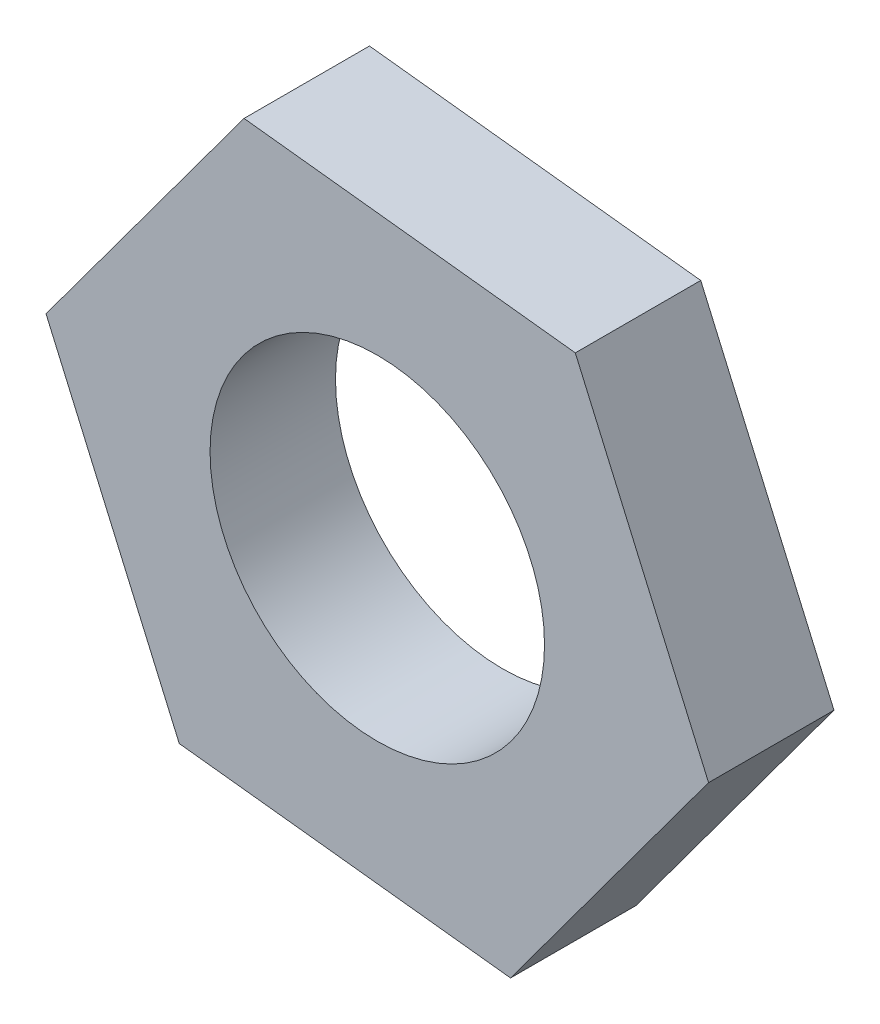
ISO-10303-21;
HEADER;
FILE_DESCRIPTION(('STEP AP214'),'2;1');
FILE_NAME('part.step','',(''),(''),'','','');
FILE_SCHEMA(('AUTOMOTIVE_DESIGN { 1 0 10303 214 1 1 1 1 }'));
ENDSEC;
DATA;
#1=APPLICATION_CONTEXT('core data for automotive mechanical design processes');
#2=APPLICATION_PROTOCOL_DEFINITION('international standard','automotive_design',2000,#1);
#3=PRODUCT_CONTEXT('',#1,'mechanical');
#4=PRODUCT('Part','Part','',(#3));
#5=PRODUCT_RELATED_PRODUCT_CATEGORY('part','',(#4));
#6=PRODUCT_DEFINITION_FORMATION('','',#4);
#7=PRODUCT_DEFINITION_CONTEXT('part definition',#1,'design');
#8=PRODUCT_DEFINITION('design','',#6,#7);
#9=PRODUCT_DEFINITION_SHAPE('','',#8);
#10=(LENGTH_UNIT() NAMED_UNIT(*) SI_UNIT(.MILLI.,.METRE.));
#11=(NAMED_UNIT(*) PLANE_ANGLE_UNIT() SI_UNIT($,.RADIAN.));
#12=(NAMED_UNIT(*) SI_UNIT($,.STERADIAN.) SOLID_ANGLE_UNIT());
#13=UNCERTAINTY_MEASURE_WITH_UNIT(LENGTH_MEASURE(1.E-05),#10,'distance_accuracy_value','');
#14=(GEOMETRIC_REPRESENTATION_CONTEXT(3) GLOBAL_UNCERTAINTY_ASSIGNED_CONTEXT((#13)) GLOBAL_UNIT_ASSIGNED_CONTEXT((#10,
#11,#12)) REPRESENTATION_CONTEXT('',''));
#15=CARTESIAN_POINT('',(0.,0.,0.));
#16=DIRECTION('',(0.,0.,1.));
#17=DIRECTION('',(1.,0.,0.));
#18=AXIS2_PLACEMENT_3D('',#15,#16,#17);
#19=CARTESIAN_POINT('',(3.18715346438534,-7.3094138908074,3.));
#20=DIRECTION('',(0.,0.,1.));
#21=DIRECTION('',(1.,0.,0.));
#22=AXIS2_PLACEMENT_3D('',#19,#20,#21);
#23=PLANE('',#22);
#24=DIRECTION('',(0.993687589434149,-0.112182773207608,0.));
#25=VECTOR('',#24,1.);
#26=CARTESIAN_POINT('',(-4.73656138402139,-6.41486281132099,3.));
#27=LINE('',#26,#25);
#28=CARTESIAN_POINT('',(-4.73656138402139,-6.41486281132099,3.));
#29=VERTEX_POINT('',#28);
#30=CARTESIAN_POINT('',(3.18715346438534,-7.3094138908074,3.));
#31=VERTEX_POINT('',#30);
#32=EDGE_CURVE('E129',#29,#31,#27,.T.);
#33=ORIENTED_EDGE('',*,*,#32,.T.);
#34=DIRECTION('',(0.593996926181851,0.804467309271491,0.));
#35=VECTOR('',#34,1.);
#36=CARTESIAN_POINT('',(3.18715346438534,-7.3094138908074,3.));
#37=LINE('',#36,#35);
#38=CARTESIAN_POINT('',(7.92371484840673,-0.894551079486403,3.));
#39=VERTEX_POINT('',#38);
#40=EDGE_CURVE('E87',#31,#39,#37,.T.);
#41=ORIENTED_EDGE('',*,*,#40,.T.);
#42=DIRECTION('',(-0.399690663252298,0.916650082479099,0.));
#43=VECTOR('',#42,1.);
#44=CARTESIAN_POINT('',(7.92371484840673,-0.894551079486403,3.));
#45=LINE('',#44,#43);
#46=CARTESIAN_POINT('',(4.73656138402139,6.41486281132099,3.));
#47=VERTEX_POINT('',#46);
#48=EDGE_CURVE('E100',#39,#47,#45,.T.);
#49=ORIENTED_EDGE('',*,*,#48,.T.);
#50=DIRECTION('',(-0.993687589434149,0.112182773207607,0.));
#51=VECTOR('',#50,1.);
#52=CARTESIAN_POINT('',(4.73656138402139,6.41486281132099,3.));
#53=LINE('',#52,#51);
#54=CARTESIAN_POINT('',(-3.18715346438534,7.3094138908074,3.));
#55=VERTEX_POINT('',#54);
#56=EDGE_CURVE('E94',#47,#55,#53,.T.);
#57=ORIENTED_EDGE('',*,*,#56,.T.);
#58=DIRECTION('',(-0.593996926181851,-0.804467309271491,0.));
#59=VECTOR('',#58,1.);
#60=CARTESIAN_POINT('',(-3.18715346438534,7.3094138908074,3.));
#61=LINE('',#60,#59);
#62=CARTESIAN_POINT('',(-7.92371484840673,0.894551079486407,3.));
#63=VERTEX_POINT('',#62);
#64=EDGE_CURVE('E98',#55,#63,#61,.T.);
#65=ORIENTED_EDGE('',*,*,#64,.T.);
#66=DIRECTION('',(0.399690663252298,-0.916650082479098,0.));
#67=VECTOR('',#66,1.);
#68=CARTESIAN_POINT('',(-7.92371484840673,0.894551079486407,3.));
#69=LINE('',#68,#67);
#70=EDGE_CURVE('E50',#63,#29,#69,.T.);
#71=ORIENTED_EDGE('',*,*,#70,.T.);
#72=EDGE_LOOP('',(#33,#41,#49,#57,#65,#71));
#73=FACE_BOUND('',#72,.T.);
#74=CARTESIAN_POINT('',(0.,0.,3.));
#75=DIRECTION('',(0.,0.,1.));
#76=DIRECTION('',(1.,0.,0.));
#77=AXIS2_PLACEMENT_3D('',#74,#75,#76);
#78=CIRCLE('',#77,4.);
#79=CARTESIAN_POINT('',(4.,0.,3.));
#80=VERTEX_POINT('',#79);
#81=EDGE_CURVE('E122',#80,#80,#78,.T.);
#82=ORIENTED_EDGE('',*,*,#81,.F.);
#83=EDGE_LOOP('',(#82));
#84=FACE_BOUND('',#83,.T.);
#85=ADVANCED_FACE('F33',(#73,#84),#23,.T.);
#86=CARTESIAN_POINT('',(3.18715346438534,-7.3094138908074,0.));
#87=DIRECTION('',(0.,0.,1.));
#88=DIRECTION('',(1.,0.,0.));
#89=AXIS2_PLACEMENT_3D('',#86,#87,#88);
#90=PLANE('',#89);
#91=DIRECTION('',(0.993687589434149,-0.112182773207608,0.));
#92=VECTOR('',#91,1.);
#93=CARTESIAN_POINT('',(-4.73656138402139,-6.41486281132099,0.));
#94=LINE('',#93,#92);
#95=CARTESIAN_POINT('',(-4.73656138402139,-6.41486281132099,0.));
#96=VERTEX_POINT('',#95);
#97=CARTESIAN_POINT('',(3.18715346438534,-7.3094138908074,0.));
#98=VERTEX_POINT('',#97);
#99=EDGE_CURVE('E118',#96,#98,#94,.T.);
#100=ORIENTED_EDGE('',*,*,#99,.F.);
#101=DIRECTION('',(0.399690663252298,-0.916650082479098,0.));
#102=VECTOR('',#101,1.);
#103=CARTESIAN_POINT('',(-7.92371484840673,0.894551079486407,0.));
#104=LINE('',#103,#102);
#105=CARTESIAN_POINT('',(-7.92371484840673,0.894551079486407,0.));
#106=VERTEX_POINT('',#105);
#107=EDGE_CURVE('E79',#106,#96,#104,.T.);
#108=ORIENTED_EDGE('',*,*,#107,.F.);
#109=DIRECTION('',(-0.593996926181851,-0.804467309271491,0.));
#110=VECTOR('',#109,1.);
#111=CARTESIAN_POINT('',(-3.18715346438534,7.3094138908074,0.));
#112=LINE('',#111,#110);
#113=CARTESIAN_POINT('',(-3.18715346438534,7.3094138908074,0.));
#114=VERTEX_POINT('',#113);
#115=EDGE_CURVE('E73',#114,#106,#112,.T.);
#116=ORIENTED_EDGE('',*,*,#115,.F.);
#117=DIRECTION('',(-0.993687589434149,0.112182773207607,0.));
#118=VECTOR('',#117,1.);
#119=CARTESIAN_POINT('',(4.73656138402139,6.41486281132099,0.));
#120=LINE('',#119,#118);
#121=CARTESIAN_POINT('',(4.73656138402139,6.41486281132099,0.));
#122=VERTEX_POINT('',#121);
#123=EDGE_CURVE('E108',#122,#114,#120,.T.);
#124=ORIENTED_EDGE('',*,*,#123,.F.);
#125=DIRECTION('',(-0.399690663252298,0.916650082479099,0.));
#126=VECTOR('',#125,1.);
#127=CARTESIAN_POINT('',(7.92371484840673,-0.894551079486403,0.));
#128=LINE('',#127,#126);
#129=CARTESIAN_POINT('',(7.92371484840673,-0.894551079486403,0.));
#130=VERTEX_POINT('',#129);
#131=EDGE_CURVE('E124',#130,#122,#128,.T.);
#132=ORIENTED_EDGE('',*,*,#131,.F.);
#133=DIRECTION('',(0.593996926181851,0.804467309271491,0.));
#134=VECTOR('',#133,1.);
#135=CARTESIAN_POINT('',(3.18715346438534,-7.3094138908074,0.));
#136=LINE('',#135,#134);
#137=EDGE_CURVE('E121',#98,#130,#136,.T.);
#138=ORIENTED_EDGE('',*,*,#137,.F.);
#139=EDGE_LOOP('',(#100,#108,#116,#124,#132,#138));
#140=FACE_BOUND('',#139,.T.);
#141=CARTESIAN_POINT('',(0.,0.,0.));
#142=DIRECTION('',(0.,0.,1.));
#143=DIRECTION('',(1.,0.,0.));
#144=AXIS2_PLACEMENT_3D('',#141,#142,#143);
#145=CIRCLE('',#144,4.);
#146=CARTESIAN_POINT('',(4.,0.,0.));
#147=VERTEX_POINT('',#146);
#148=EDGE_CURVE('E222',#147,#147,#145,.T.);
#149=ORIENTED_EDGE('',*,*,#148,.T.);
#150=EDGE_LOOP('',(#149));
#151=FACE_BOUND('',#150,.T.);
#152=ADVANCED_FACE('F138',(#140,#151),#90,.F.);
#153=CARTESIAN_POINT('',(-4.73656138402139,-6.41486281132099,3.));
#154=DIRECTION('',(0.112182773207608,0.993687589434149,0.));
#155=DIRECTION('',(-0.993687589434149,0.112182773207608,0.));
#156=AXIS2_PLACEMENT_3D('',#153,#154,#155);
#157=PLANE('',#156);
#158=ORIENTED_EDGE('',*,*,#99,.T.);
#159=DIRECTION('',(0.,0.,-1.));
#160=VECTOR('',#159,1.);
#161=CARTESIAN_POINT('',(3.18715346438534,-7.3094138908074,3.));
#162=LINE('',#161,#160);
#163=EDGE_CURVE('E11',#31,#98,#162,.T.);
#164=ORIENTED_EDGE('',*,*,#163,.F.);
#165=ORIENTED_EDGE('',*,*,#32,.F.);
#166=DIRECTION('',(0.,0.,-1.));
#167=VECTOR('',#166,1.);
#168=CARTESIAN_POINT('',(-4.73656138402139,-6.41486281132099,3.));
#169=LINE('',#168,#167);
#170=EDGE_CURVE('E114',#29,#96,#169,.T.);
#171=ORIENTED_EDGE('',*,*,#170,.T.);
#172=EDGE_LOOP('',(#158,#164,#165,#171));
#173=FACE_BOUND('',#172,.T.);
#174=ADVANCED_FACE('F35',(#173),#157,.F.);
#175=CARTESIAN_POINT('',(3.18715346438534,-7.3094138908074,3.));
#176=DIRECTION('',(-0.804467309271491,0.593996926181851,0.));
#177=DIRECTION('',(-0.593996926181851,-0.804467309271491,0.));
#178=AXIS2_PLACEMENT_3D('',#175,#176,#177);
#179=PLANE('',#178);
#180=ORIENTED_EDGE('',*,*,#137,.T.);
#181=DIRECTION('',(0.,0.,-1.));
#182=VECTOR('',#181,1.);
#183=CARTESIAN_POINT('',(7.92371484840673,-0.894551079486403,3.));
#184=LINE('',#183,#182);
#185=EDGE_CURVE('E42',#39,#130,#184,.T.);
#186=ORIENTED_EDGE('',*,*,#185,.F.);
#187=ORIENTED_EDGE('',*,*,#40,.F.);
#188=ORIENTED_EDGE('',*,*,#163,.T.);
#189=EDGE_LOOP('',(#180,#186,#187,#188));
#190=FACE_BOUND('',#189,.T.);
#191=ADVANCED_FACE('F163',(#190),#179,.F.);
#192=CARTESIAN_POINT('',(7.92371484840673,-0.894551079486403,3.));
#193=DIRECTION('',(-0.916650082479098,-0.399690663252298,0.));
#194=DIRECTION('',(0.399690663252298,-0.916650082479099,0.));
#195=AXIS2_PLACEMENT_3D('',#192,#193,#194);
#196=PLANE('',#195);
#197=ORIENTED_EDGE('',*,*,#131,.T.);
#198=DIRECTION('',(0.,0.,-1.));
#199=VECTOR('',#198,1.);
#200=CARTESIAN_POINT('',(4.73656138402139,6.41486281132099,3.));
#201=LINE('',#200,#199);
#202=EDGE_CURVE('E109',#47,#122,#201,.T.);
#203=ORIENTED_EDGE('',*,*,#202,.F.);
#204=ORIENTED_EDGE('',*,*,#48,.F.);
#205=ORIENTED_EDGE('',*,*,#185,.T.);
#206=EDGE_LOOP('',(#197,#203,#204,#205));
#207=FACE_BOUND('',#206,.T.);
#208=ADVANCED_FACE('F135',(#207),#196,.F.);
#209=CARTESIAN_POINT('',(4.73656138402139,6.41486281132099,3.));
#210=DIRECTION('',(-0.112182773207607,-0.993687589434149,0.));
#211=DIRECTION('',(0.993687589434149,-0.112182773207607,0.));
#212=AXIS2_PLACEMENT_3D('',#209,#210,#211);
#213=PLANE('',#212);
#214=ORIENTED_EDGE('',*,*,#123,.T.);
#215=DIRECTION('',(0.,0.,-1.));
#216=VECTOR('',#215,1.);
#217=CARTESIAN_POINT('',(-3.18715346438534,7.3094138908074,3.));
#218=LINE('',#217,#216);
#219=EDGE_CURVE('E105',#55,#114,#218,.T.);
#220=ORIENTED_EDGE('',*,*,#219,.F.);
#221=ORIENTED_EDGE('',*,*,#56,.F.);
#222=ORIENTED_EDGE('',*,*,#202,.T.);
#223=EDGE_LOOP('',(#214,#220,#221,#222));
#224=FACE_BOUND('',#223,.T.);
#225=ADVANCED_FACE('F106',(#224),#213,.F.);
#226=CARTESIAN_POINT('',(-3.18715346438534,7.3094138908074,3.));
#227=DIRECTION('',(0.804467309271491,-0.593996926181851,0.));
#228=DIRECTION('',(0.593996926181851,0.804467309271491,0.));
#229=AXIS2_PLACEMENT_3D('',#226,#227,#228);
#230=PLANE('',#229);
#231=ORIENTED_EDGE('',*,*,#115,.T.);
#232=DIRECTION('',(0.,0.,-1.));
#233=VECTOR('',#232,1.);
#234=CARTESIAN_POINT('',(-7.92371484840673,0.894551079486407,3.));
#235=LINE('',#234,#233);
#236=EDGE_CURVE('E110',#63,#106,#235,.T.);
#237=ORIENTED_EDGE('',*,*,#236,.F.);
#238=ORIENTED_EDGE('',*,*,#64,.F.);
#239=ORIENTED_EDGE('',*,*,#219,.T.);
#240=EDGE_LOOP('',(#231,#237,#238,#239));
#241=FACE_BOUND('',#240,.T.);
#242=ADVANCED_FACE('F112',(#241),#230,.F.);
#243=CARTESIAN_POINT('',(-7.92371484840673,0.894551079486407,3.));
#244=DIRECTION('',(0.916650082479098,0.399690663252298,0.));
#245=DIRECTION('',(-0.399690663252298,0.916650082479099,0.));
#246=AXIS2_PLACEMENT_3D('',#243,#244,#245);
#247=PLANE('',#246);
#248=ORIENTED_EDGE('',*,*,#107,.T.);
#249=ORIENTED_EDGE('',*,*,#170,.F.);
#250=ORIENTED_EDGE('',*,*,#70,.F.);
#251=ORIENTED_EDGE('',*,*,#236,.T.);
#252=EDGE_LOOP('',(#248,#249,#250,#251));
#253=FACE_BOUND('',#252,.T.);
#254=ADVANCED_FACE('F143',(#253),#247,.F.);
#255=CARTESIAN_POINT('',(0.,0.,3.));
#256=DIRECTION('',(0.,0.,-1.));
#257=DIRECTION('',(-1.,0.,0.));
#258=AXIS2_PLACEMENT_3D('',#255,#256,#257);
#259=CYLINDRICAL_SURFACE('',#258,4.);
#260=ORIENTED_EDGE('',*,*,#81,.T.);
#261=EDGE_LOOP('',(#260));
#262=FACE_BOUND('',#261,.T.);
#263=ORIENTED_EDGE('',*,*,#148,.F.);
#264=EDGE_LOOP('',(#263));
#265=FACE_BOUND('',#264,.T.);
#266=ADVANCED_FACE('F145',(#262,#265),#259,.F.);
#267=CLOSED_SHELL('',(#85,#152,#174,#191,#208,#225,#242,#254,#266));
#268=MANIFOLD_SOLID_BREP('B2',#267);
#269=ADVANCED_BREP_SHAPE_REPRESENTATION('',(#18,#268),#14);
#270=SHAPE_DEFINITION_REPRESENTATION(#9,#269);
ENDSEC;
END-ISO-10303-21;
